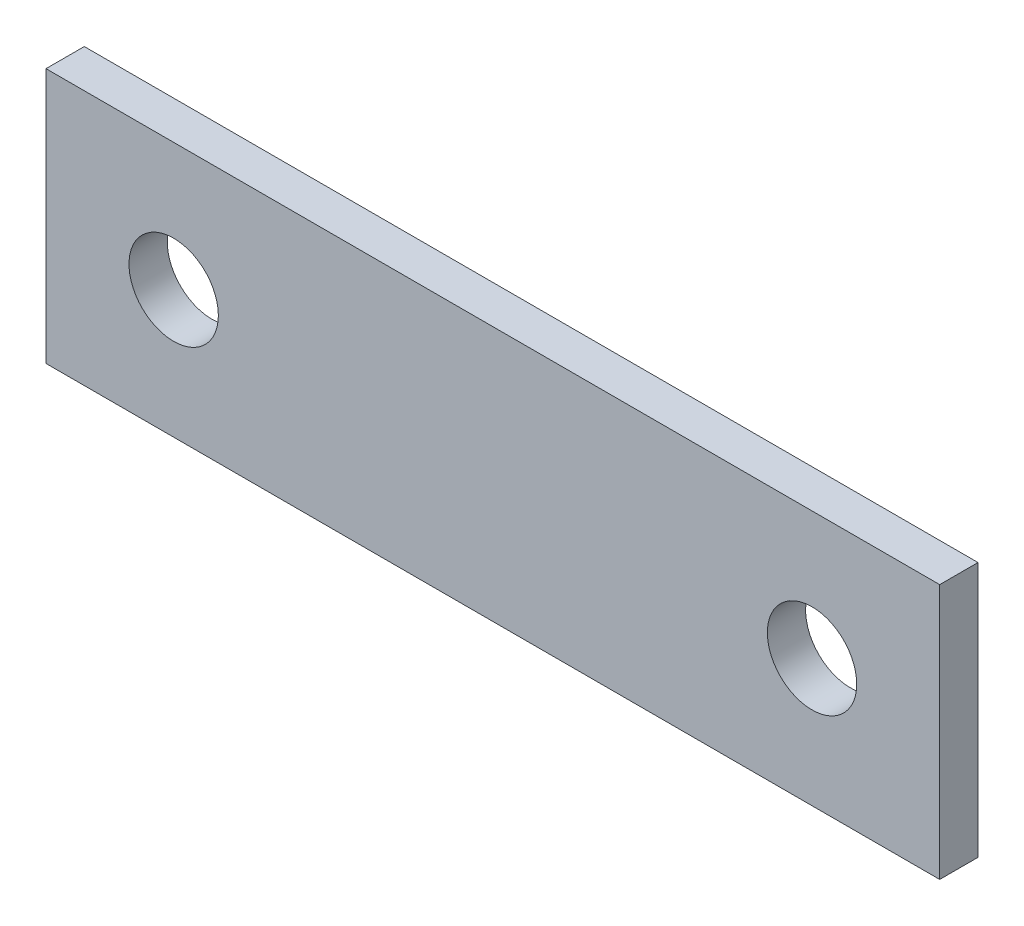
ISO-10303-21;
HEADER;
FILE_DESCRIPTION(('STEP AP214'),'2;1');
FILE_NAME('part.step','',(''),(''),'','','');
FILE_SCHEMA(('AUTOMOTIVE_DESIGN { 1 0 10303 214 1 1 1 1 }'));
ENDSEC;
DATA;
#1=APPLICATION_CONTEXT('core data for automotive mechanical design processes');
#2=APPLICATION_PROTOCOL_DEFINITION('international standard','automotive_design',2000,#1);
#3=PRODUCT_CONTEXT('',#1,'mechanical');
#4=PRODUCT('Part','Part','',(#3));
#5=PRODUCT_RELATED_PRODUCT_CATEGORY('part','',(#4));
#6=PRODUCT_DEFINITION_FORMATION('','',#4);
#7=PRODUCT_DEFINITION_CONTEXT('part definition',#1,'design');
#8=PRODUCT_DEFINITION('design','',#6,#7);
#9=PRODUCT_DEFINITION_SHAPE('','',#8);
#10=(LENGTH_UNIT() NAMED_UNIT(*) SI_UNIT(.MILLI.,.METRE.));
#11=(NAMED_UNIT(*) PLANE_ANGLE_UNIT() SI_UNIT($,.RADIAN.));
#12=(NAMED_UNIT(*) SI_UNIT($,.STERADIAN.) SOLID_ANGLE_UNIT());
#13=UNCERTAINTY_MEASURE_WITH_UNIT(LENGTH_MEASURE(1.E-05),#10,'distance_accuracy_value','');
#14=(GEOMETRIC_REPRESENTATION_CONTEXT(3) GLOBAL_UNCERTAINTY_ASSIGNED_CONTEXT((#13)) GLOBAL_UNIT_ASSIGNED_CONTEXT((#10,
#11,#12)) REPRESENTATION_CONTEXT('',''));
#15=CARTESIAN_POINT('',(0.,0.,0.));
#16=DIRECTION('',(0.,0.,1.));
#17=DIRECTION('',(1.,0.,0.));
#18=AXIS2_PLACEMENT_3D('',#15,#16,#17);
#19=CARTESIAN_POINT('',(0.,0.,3.));
#20=DIRECTION('',(0.,0.,1.));
#21=DIRECTION('',(1.,0.,0.));
#22=AXIS2_PLACEMENT_3D('',#19,#20,#21);
#23=PLANE('',#22);
#24=CARTESIAN_POINT('',(-71.8884938213024,16.0052859618717,3.));
#25=DIRECTION('',(0.,0.,1.));
#26=DIRECTION('',(1.,0.,0.));
#27=AXIS2_PLACEMENT_3D('',#24,#25,#26);
#28=CIRCLE('',#27,3.50000000000001);
#29=CARTESIAN_POINT('',(-68.3884938213024,16.0052859618717,3.));
#30=VERTEX_POINT('',#29);
#31=EDGE_CURVE('E99',#30,#30,#28,.T.);
#32=ORIENTED_EDGE('',*,*,#31,.F.);
#33=EDGE_LOOP('',(#32));
#34=FACE_BOUND('',#33,.T.);
#35=DIRECTION('',(0.,-1.,0.));
#36=VECTOR('',#35,1.);
#37=CARTESIAN_POINT('',(-81.8884938213024,26.0052859618718,3.));
#38=LINE('',#37,#36);
#39=CARTESIAN_POINT('',(-81.8884938213024,26.0052859618718,3.));
#40=VERTEX_POINT('',#39);
#41=CARTESIAN_POINT('',(-81.8884938213024,6.00528596187175,3.));
#42=VERTEX_POINT('',#41);
#43=EDGE_CURVE('E84',#40,#42,#38,.T.);
#44=ORIENTED_EDGE('',*,*,#43,.T.);
#45=DIRECTION('',(1.,0.,0.));
#46=VECTOR('',#45,1.);
#47=CARTESIAN_POINT('',(-81.8884938213024,6.00528596187175,3.));
#48=LINE('',#47,#46);
#49=CARTESIAN_POINT('',(-11.8884938213024,6.00528596187175,3.));
#50=VERTEX_POINT('',#49);
#51=EDGE_CURVE('E79',#42,#50,#48,.T.);
#52=ORIENTED_EDGE('',*,*,#51,.T.);
#53=DIRECTION('',(0.,1.,0.));
#54=VECTOR('',#53,1.);
#55=CARTESIAN_POINT('',(-11.8884938213024,26.0052859618718,3.));
#56=LINE('',#55,#54);
#57=CARTESIAN_POINT('',(-11.8884938213024,26.0052859618718,3.));
#58=VERTEX_POINT('',#57);
#59=EDGE_CURVE('E82',#50,#58,#56,.T.);
#60=ORIENTED_EDGE('',*,*,#59,.T.);
#61=DIRECTION('',(-1.,0.,0.));
#62=VECTOR('',#61,1.);
#63=CARTESIAN_POINT('',(-81.8884938213024,26.0052859618718,3.));
#64=LINE('',#63,#62);
#65=EDGE_CURVE('E49',#58,#40,#64,.T.);
#66=ORIENTED_EDGE('',*,*,#65,.T.);
#67=EDGE_LOOP('',(#44,#52,#60,#66));
#68=FACE_BOUND('',#67,.T.);
#69=CARTESIAN_POINT('',(-21.8884938213024,16.0052859618717,3.));
#70=DIRECTION('',(0.,0.,1.));
#71=DIRECTION('',(1.,0.,0.));
#72=AXIS2_PLACEMENT_3D('',#69,#70,#71);
#73=CIRCLE('',#72,3.5);
#74=CARTESIAN_POINT('',(-18.3884938213024,16.0052859618717,3.));
#75=VERTEX_POINT('',#74);
#76=EDGE_CURVE('E114',#75,#75,#73,.T.);
#77=ORIENTED_EDGE('',*,*,#76,.F.);
#78=EDGE_LOOP('',(#77));
#79=FACE_BOUND('',#78,.T.);
#80=ADVANCED_FACE('F32',(#34,#68,#79),#23,.T.);
#81=CARTESIAN_POINT('',(0.,0.,0.));
#82=DIRECTION('',(0.,0.,1.));
#83=DIRECTION('',(1.,0.,0.));
#84=AXIS2_PLACEMENT_3D('',#81,#82,#83);
#85=PLANE('',#84);
#86=DIRECTION('',(0.,-1.,0.));
#87=VECTOR('',#86,1.);
#88=CARTESIAN_POINT('',(-81.8884938213024,26.0052859618718,0.));
#89=LINE('',#88,#87);
#90=CARTESIAN_POINT('',(-81.8884938213024,26.0052859618718,0.));
#91=VERTEX_POINT('',#90);
#92=CARTESIAN_POINT('',(-81.8884938213024,6.00528596187175,0.));
#93=VERTEX_POINT('',#92);
#94=EDGE_CURVE('E96',#91,#93,#89,.T.);
#95=ORIENTED_EDGE('',*,*,#94,.F.);
#96=DIRECTION('',(-1.,0.,0.));
#97=VECTOR('',#96,1.);
#98=CARTESIAN_POINT('',(-81.8884938213024,26.0052859618718,0.));
#99=LINE('',#98,#97);
#100=CARTESIAN_POINT('',(-11.8884938213024,26.0052859618718,0.));
#101=VERTEX_POINT('',#100);
#102=EDGE_CURVE('E72',#101,#91,#99,.T.);
#103=ORIENTED_EDGE('',*,*,#102,.F.);
#104=DIRECTION('',(0.,1.,0.));
#105=VECTOR('',#104,1.);
#106=CARTESIAN_POINT('',(-11.8884938213024,26.0052859618718,0.));
#107=LINE('',#106,#105);
#108=CARTESIAN_POINT('',(-11.8884938213024,6.00528596187175,0.));
#109=VERTEX_POINT('',#108);
#110=EDGE_CURVE('E66',#109,#101,#107,.T.);
#111=ORIENTED_EDGE('',*,*,#110,.F.);
#112=DIRECTION('',(1.,0.,0.));
#113=VECTOR('',#112,1.);
#114=CARTESIAN_POINT('',(-81.8884938213024,6.00528596187175,0.));
#115=LINE('',#114,#113);
#116=EDGE_CURVE('E88',#93,#109,#115,.T.);
#117=ORIENTED_EDGE('',*,*,#116,.F.);
#118=EDGE_LOOP('',(#95,#103,#111,#117));
#119=FACE_BOUND('',#118,.T.);
#120=CARTESIAN_POINT('',(-71.8884938213024,16.0052859618717,0.));
#121=DIRECTION('',(0.,0.,1.));
#122=DIRECTION('',(1.,0.,0.));
#123=AXIS2_PLACEMENT_3D('',#120,#121,#122);
#124=CIRCLE('',#123,3.50000000000001);
#125=CARTESIAN_POINT('',(-68.3884938213024,16.0052859618717,0.));
#126=VERTEX_POINT('',#125);
#127=EDGE_CURVE('E111',#126,#126,#124,.T.);
#128=ORIENTED_EDGE('',*,*,#127,.T.);
#129=EDGE_LOOP('',(#128));
#130=FACE_BOUND('',#129,.T.);
#131=CARTESIAN_POINT('',(-21.8884938213024,16.0052859618717,0.));
#132=DIRECTION('',(0.,0.,1.));
#133=DIRECTION('',(1.,0.,0.));
#134=AXIS2_PLACEMENT_3D('',#131,#132,#133);
#135=CIRCLE('',#134,3.5);
#136=CARTESIAN_POINT('',(-18.3884938213024,16.0052859618717,0.));
#137=VERTEX_POINT('',#136);
#138=EDGE_CURVE('E117',#137,#137,#135,.T.);
#139=ORIENTED_EDGE('',*,*,#138,.T.);
#140=EDGE_LOOP('',(#139));
#141=FACE_BOUND('',#140,.T.);
#142=ADVANCED_FACE('F107',(#119,#130,#141),#85,.F.);
#143=CARTESIAN_POINT('',(-81.8884938213024,26.0052859618718,3.));
#144=DIRECTION('',(1.,0.,0.));
#145=DIRECTION('',(0.,0.,-1.));
#146=AXIS2_PLACEMENT_3D('',#143,#144,#145);
#147=PLANE('',#146);
#148=ORIENTED_EDGE('',*,*,#94,.T.);
#149=DIRECTION('',(0.,0.,-1.));
#150=VECTOR('',#149,1.);
#151=CARTESIAN_POINT('',(-81.8884938213024,6.00528596187175,3.));
#152=LINE('',#151,#150);
#153=EDGE_CURVE('E11',#42,#93,#152,.T.);
#154=ORIENTED_EDGE('',*,*,#153,.F.);
#155=ORIENTED_EDGE('',*,*,#43,.F.);
#156=DIRECTION('',(0.,0.,-1.));
#157=VECTOR('',#156,1.);
#158=CARTESIAN_POINT('',(-81.8884938213024,26.0052859618718,3.));
#159=LINE('',#158,#157);
#160=EDGE_CURVE('E92',#40,#91,#159,.T.);
#161=ORIENTED_EDGE('',*,*,#160,.T.);
#162=EDGE_LOOP('',(#148,#154,#155,#161));
#163=FACE_BOUND('',#162,.T.);
#164=ADVANCED_FACE('F34',(#163),#147,.F.);
#165=CARTESIAN_POINT('',(-81.8884938213024,6.00528596187175,3.));
#166=DIRECTION('',(0.,1.,0.));
#167=DIRECTION('',(0.,0.,1.));
#168=AXIS2_PLACEMENT_3D('',#165,#166,#167);
#169=PLANE('',#168);
#170=ORIENTED_EDGE('',*,*,#116,.T.);
#171=DIRECTION('',(0.,0.,-1.));
#172=VECTOR('',#171,1.);
#173=CARTESIAN_POINT('',(-11.8884938213024,6.00528596187175,3.));
#174=LINE('',#173,#172);
#175=EDGE_CURVE('E41',#50,#109,#174,.T.);
#176=ORIENTED_EDGE('',*,*,#175,.F.);
#177=ORIENTED_EDGE('',*,*,#51,.F.);
#178=ORIENTED_EDGE('',*,*,#153,.T.);
#179=EDGE_LOOP('',(#170,#176,#177,#178));
#180=FACE_BOUND('',#179,.T.);
#181=ADVANCED_FACE('F87',(#180),#169,.F.);
#182=CARTESIAN_POINT('',(-11.8884938213024,26.0052859618718,3.));
#183=DIRECTION('',(-1.,0.,0.));
#184=DIRECTION('',(0.,0.,1.));
#185=AXIS2_PLACEMENT_3D('',#182,#183,#184);
#186=PLANE('',#185);
#187=ORIENTED_EDGE('',*,*,#110,.T.);
#188=DIRECTION('',(0.,0.,-1.));
#189=VECTOR('',#188,1.);
#190=CARTESIAN_POINT('',(-11.8884938213024,26.0052859618718,3.));
#191=LINE('',#190,#189);
#192=EDGE_CURVE('E89',#58,#101,#191,.T.);
#193=ORIENTED_EDGE('',*,*,#192,.F.);
#194=ORIENTED_EDGE('',*,*,#59,.F.);
#195=ORIENTED_EDGE('',*,*,#175,.T.);
#196=EDGE_LOOP('',(#187,#193,#194,#195));
#197=FACE_BOUND('',#196,.T.);
#198=ADVANCED_FACE('F90',(#197),#186,.F.);
#199=CARTESIAN_POINT('',(-81.8884938213024,26.0052859618718,3.));
#200=DIRECTION('',(0.,-1.,0.));
#201=DIRECTION('',(0.,0.,-1.));
#202=AXIS2_PLACEMENT_3D('',#199,#200,#201);
#203=PLANE('',#202);
#204=ORIENTED_EDGE('',*,*,#102,.T.);
#205=ORIENTED_EDGE('',*,*,#160,.F.);
#206=ORIENTED_EDGE('',*,*,#65,.F.);
#207=ORIENTED_EDGE('',*,*,#192,.T.);
#208=EDGE_LOOP('',(#204,#205,#206,#207));
#209=FACE_BOUND('',#208,.T.);
#210=ADVANCED_FACE('F104',(#209),#203,.F.);
#211=CARTESIAN_POINT('',(-71.8884938213024,16.0052859618717,3.));
#212=DIRECTION('',(0.,0.,-1.));
#213=DIRECTION('',(-1.,0.,0.));
#214=AXIS2_PLACEMENT_3D('',#211,#212,#213);
#215=CYLINDRICAL_SURFACE('',#214,3.50000000000001);
#216=ORIENTED_EDGE('',*,*,#31,.T.);
#217=EDGE_LOOP('',(#216));
#218=FACE_BOUND('',#217,.T.);
#219=ORIENTED_EDGE('',*,*,#127,.F.);
#220=EDGE_LOOP('',(#219));
#221=FACE_BOUND('',#220,.T.);
#222=ADVANCED_FACE('F134',(#218,#221),#215,.F.);
#223=CARTESIAN_POINT('',(-21.8884938213024,16.0052859618717,3.));
#224=DIRECTION('',(0.,0.,-1.));
#225=DIRECTION('',(-1.,0.,0.));
#226=AXIS2_PLACEMENT_3D('',#223,#224,#225);
#227=CYLINDRICAL_SURFACE('',#226,3.5);
#228=ORIENTED_EDGE('',*,*,#76,.T.);
#229=EDGE_LOOP('',(#228));
#230=FACE_BOUND('',#229,.T.);
#231=ORIENTED_EDGE('',*,*,#138,.F.);
#232=EDGE_LOOP('',(#231));
#233=FACE_BOUND('',#232,.T.);
#234=ADVANCED_FACE('F123',(#230,#233),#227,.F.);
#235=CLOSED_SHELL('',(#80,#142,#164,#181,#198,#210,#222,#234));
#236=MANIFOLD_SOLID_BREP('B2',#235);
#237=ADVANCED_BREP_SHAPE_REPRESENTATION('',(#18,#236),#14);
#238=SHAPE_DEFINITION_REPRESENTATION(#9,#237);
ENDSEC;
END-ISO-10303-21;
